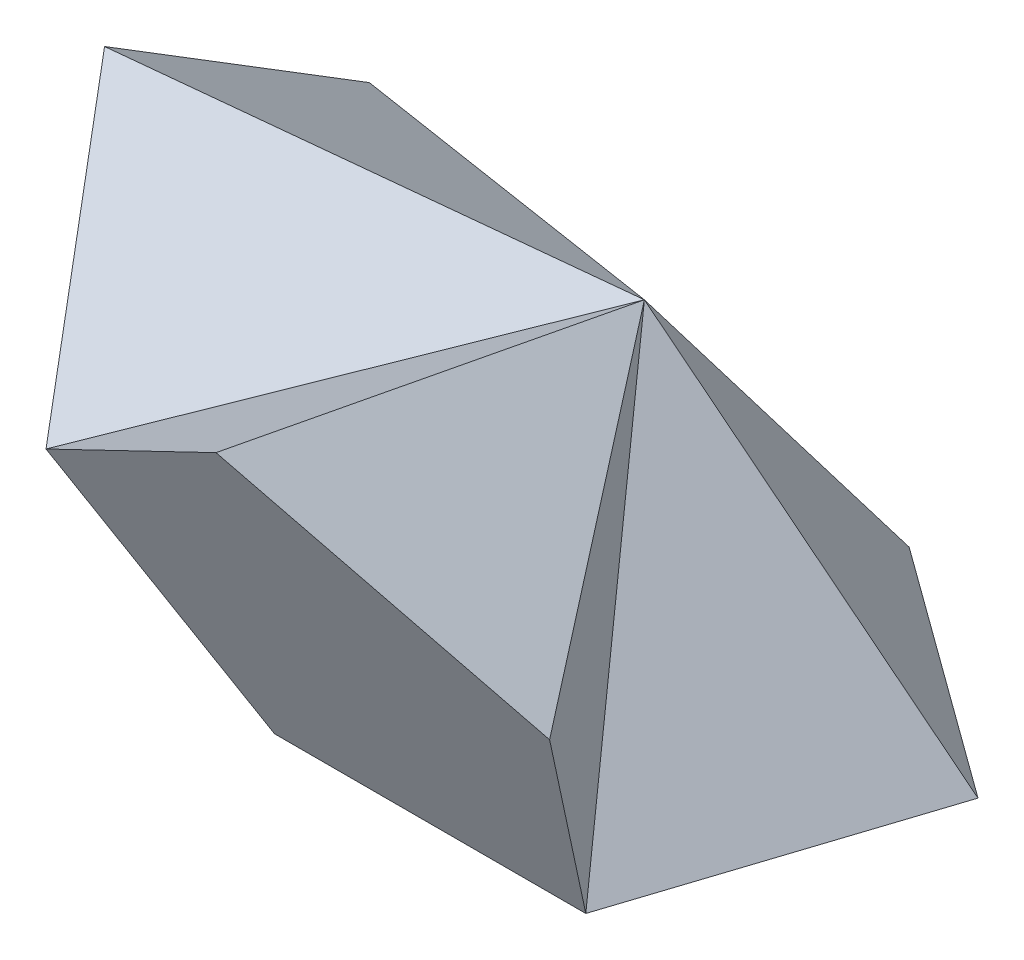
ISO-10303-21;
HEADER;
FILE_DESCRIPTION(('STEP AP214'),'2;1');
FILE_NAME('part.step','',(''),(''),'','','');
FILE_SCHEMA(('AUTOMOTIVE_DESIGN { 1 0 10303 214 1 1 1 1 }'));
ENDSEC;
DATA;
#1=APPLICATION_CONTEXT('core data for automotive mechanical design processes');
#2=APPLICATION_PROTOCOL_DEFINITION('international standard','automotive_design',2000,#1);
#3=PRODUCT_CONTEXT('',#1,'mechanical');
#4=PRODUCT('Part','Part','',(#3));
#5=PRODUCT_RELATED_PRODUCT_CATEGORY('part','',(#4));
#6=PRODUCT_DEFINITION_FORMATION('','',#4);
#7=PRODUCT_DEFINITION_CONTEXT('part definition',#1,'design');
#8=PRODUCT_DEFINITION('design','',#6,#7);
#9=PRODUCT_DEFINITION_SHAPE('','',#8);
#10=(LENGTH_UNIT() NAMED_UNIT(*) SI_UNIT(.MILLI.,.METRE.));
#11=(NAMED_UNIT(*) PLANE_ANGLE_UNIT() SI_UNIT($,.RADIAN.));
#12=(NAMED_UNIT(*) SI_UNIT($,.STERADIAN.) SOLID_ANGLE_UNIT());
#13=UNCERTAINTY_MEASURE_WITH_UNIT(LENGTH_MEASURE(1.E-05),#10,'distance_accuracy_value','');
#14=(GEOMETRIC_REPRESENTATION_CONTEXT(3) GLOBAL_UNCERTAINTY_ASSIGNED_CONTEXT((#13)) GLOBAL_UNIT_ASSIGNED_CONTEXT((#10,
#11,#12)) REPRESENTATION_CONTEXT('',''));
#15=CARTESIAN_POINT('',(0.,0.,0.));
#16=DIRECTION('',(0.,0.,1.));
#17=DIRECTION('',(1.,0.,0.));
#18=AXIS2_PLACEMENT_3D('',#15,#16,#17);
#19=CARTESIAN_POINT('',(10.2745158285618,0.,-3.33839256195651));
#20=DIRECTION('',(0.499999999999999,0.525731112119135,-0.688190960235587));
#21=DIRECTION('',(0.,0.794654472291766,0.607061998206687));
#22=AXIS2_PLACEMENT_3D('',#19,#20,#21);
#23=PLANE('',#22);
#24=DIRECTION('',(-0.809016994374948,0.,-0.587785252292472));
#25=VECTOR('',#24,1.);
#26=CARTESIAN_POINT('',(10.2745158285618,0.,-3.33839256195651));
#27=LINE('',#26,#25);
#28=CARTESIAN_POINT('',(10.2745158285618,0.,-3.33839256195651));
#29=VERTEX_POINT('',#28);
#30=CARTESIAN_POINT('',(0.,0.,-10.8032652660709));
#31=VERTEX_POINT('',#30);
#32=EDGE_CURVE('E126',#29,#31,#27,.T.);
#33=ORIENTED_EDGE('',*,*,#32,.T.);
#34=DIRECTION('',(0.,-0.794654472291765,-0.607061998206687));
#35=VECTOR('',#34,1.);
#36=CARTESIAN_POINT('',(0.,0.,-10.8032652660709));
#37=LINE('',#36,#35);
#38=CARTESIAN_POINT('',(0.,14.1416578280274,0.));
#39=VERTEX_POINT('',#38);
#40=EDGE_CURVE('E11',#39,#31,#37,.T.);
#41=ORIENTED_EDGE('',*,*,#40,.F.);
#42=DIRECTION('',(0.577350269189626,-0.794654472291765,-0.187592474085081));
#43=VECTOR('',#42,1.);
#44=CARTESIAN_POINT('',(10.2745158285618,0.,-3.33839256195651));
#45=LINE('',#44,#43);
#46=EDGE_CURVE('E49',#39,#29,#45,.T.);
#47=ORIENTED_EDGE('',*,*,#46,.T.);
#48=EDGE_LOOP('',(#33,#41,#47));
#49=FACE_BOUND('',#48,.T.);
#50=ADVANCED_FACE('F33',(#49),#23,.T.);
#51=CARTESIAN_POINT('',(0.,0.,-10.8032652660709));
#52=DIRECTION('',(-0.500000000000001,0.525731112119135,-0.688190960235585));
#53=DIRECTION('',(0.,0.794654472291765,0.607061998206688));
#54=AXIS2_PLACEMENT_3D('',#51,#52,#53);
#55=PLANE('',#54);
#56=DIRECTION('',(-0.809016994374946,0.,0.587785252292474));
#57=VECTOR('',#56,1.);
#58=CARTESIAN_POINT('',(0.,0.,-10.8032652660709));
#59=LINE('',#58,#57);
#60=CARTESIAN_POINT('',(-10.2745158285618,0.,-3.33839256195648));
#61=VERTEX_POINT('',#60);
#62=EDGE_CURVE('E130',#31,#61,#59,.T.);
#63=ORIENTED_EDGE('',*,*,#62,.T.);
#64=DIRECTION('',(-0.577350269189627,-0.794654472291765,-0.187592474085079));
#65=VECTOR('',#64,1.);
#66=CARTESIAN_POINT('',(-10.2745158285618,0.,-3.33839256195648));
#67=LINE('',#66,#65);
#68=EDGE_CURVE('E37',#39,#61,#67,.T.);
#69=ORIENTED_EDGE('',*,*,#68,.F.);
#70=ORIENTED_EDGE('',*,*,#40,.T.);
#71=EDGE_LOOP('',(#63,#69,#70));
#72=FACE_BOUND('',#71,.T.);
#73=ADVANCED_FACE('F35',(#72),#55,.T.);
#74=CARTESIAN_POINT('',(6.35000000000002,0.,8.74002519499195));
#75=DIRECTION('',(0.809016994374947,0.525731112119135,0.262865556059565));
#76=DIRECTION('',(-0.544893675596392,0.838505147446963,0.));
#77=AXIS2_PLACEMENT_3D('',#74,#75,#76);
#78=PLANE('',#77);
#79=DIRECTION('',(0.309016994374946,0.,-0.951056516295154));
#80=VECTOR('',#79,1.);
#81=CARTESIAN_POINT('',(6.35000000000002,0.,8.74002519499195));
#82=LINE('',#81,#80);
#83=CARTESIAN_POINT('',(6.35000000000002,0.,8.74002519499195));
#84=VERTEX_POINT('',#83);
#85=EDGE_CURVE('E138',#84,#29,#82,.T.);
#86=ORIENTED_EDGE('',*,*,#85,.T.);
#87=ORIENTED_EDGE('',*,*,#46,.F.);
#88=DIRECTION('',(0.356822089773091,-0.794654472291765,0.491123473188423));
#89=VECTOR('',#88,1.);
#90=CARTESIAN_POINT('',(6.35000000000002,0.,8.74002519499195));
#91=LINE('',#90,#89);
#92=EDGE_CURVE('E55',#39,#84,#91,.T.);
#93=ORIENTED_EDGE('',*,*,#92,.T.);
#94=EDGE_LOOP('',(#86,#87,#93));
#95=FACE_BOUND('',#94,.T.);
#96=ADVANCED_FACE('F175',(#95),#78,.T.);
#97=CARTESIAN_POINT('',(0.,0.,0.));
#98=DIRECTION('',(0.,1.,0.));
#99=DIRECTION('',(0.,0.,1.));
#100=AXIS2_PLACEMENT_3D('',#97,#98,#99);
#101=PLANE('',#100);
#102=ORIENTED_EDGE('',*,*,#32,.F.);
#103=ORIENTED_EDGE('',*,*,#85,.F.);
#104=DIRECTION('',(1.,0.,0.));
#105=VECTOR('',#104,1.);
#106=CARTESIAN_POINT('',(-6.34999999999999,0.,8.74002519499197));
#107=LINE('',#106,#105);
#108=CARTESIAN_POINT('',(-6.34999999999999,0.,8.74002519499197));
#109=VERTEX_POINT('',#108);
#110=EDGE_CURVE('E135',#109,#84,#107,.T.);
#111=ORIENTED_EDGE('',*,*,#110,.F.);
#112=DIRECTION('',(0.309016994374949,0.,0.951056516295153));
#113=VECTOR('',#112,1.);
#114=CARTESIAN_POINT('',(-10.2745158285618,0.,-3.33839256195648));
#115=LINE('',#114,#113);
#116=EDGE_CURVE('E133',#61,#109,#115,.T.);
#117=ORIENTED_EDGE('',*,*,#116,.F.);
#118=ORIENTED_EDGE('',*,*,#62,.F.);
#119=EDGE_LOOP('',(#102,#103,#111,#117,#118));
#120=FACE_BOUND('',#119,.T.);
#121=ADVANCED_FACE('F147',(#120),#101,.F.);
#122=CARTESIAN_POINT('',(10.2745158285619,10.8032652660709,14.1416578280274));
#123=DIRECTION('',(0.5,0.850650808352039,-0.162459848116457));
#124=DIRECTION('',(-0.862103722396976,0.506731853971386,0.));
#125=AXIS2_PLACEMENT_3D('',#122,#123,#124);
#126=PLANE('',#125);
#127=DIRECTION('',(-0.809016994374947,0.525731112119134,0.262865556059567));
#128=VECTOR('',#127,1.);
#129=CARTESIAN_POINT('',(10.2745158285619,10.8032652660709,14.1416578280274));
#130=LINE('',#129,#128);
#131=CARTESIAN_POINT('',(10.2745158285619,10.8032652660709,14.1416578280274));
#132=VERTEX_POINT('',#131);
#133=CARTESIAN_POINT('',(0.,17.4800503899839,17.4800503899839));
#134=VERTEX_POINT('',#133);
#135=EDGE_CURVE('E96',#132,#134,#130,.T.);
#136=ORIENTED_EDGE('',*,*,#135,.F.);
#137=DIRECTION('',(0.577350269189628,-0.187592474085077,0.794654472291765));
#138=VECTOR('',#137,1.);
#139=CARTESIAN_POINT('',(7.65817194285396,11.6533669266559,10.5405694060037));
#140=LINE('',#139,#138);
#141=EDGE_CURVE('E124',#39,#132,#140,.T.);
#142=ORIENTED_EDGE('',*,*,#141,.F.);
#143=DIRECTION('',(0.,0.187592474085083,0.982246946376845));
#144=VECTOR('',#143,1.);
#145=CARTESIAN_POINT('',(0.,16.6299487293989,13.0288603073752));
#146=LINE('',#145,#144);
#147=EDGE_CURVE('E123',#39,#134,#146,.T.);
#148=ORIENTED_EDGE('',*,*,#147,.T.);
#149=EDGE_LOOP('',(#136,#142,#148));
#150=FACE_BOUND('',#149,.T.);
#151=ADVANCED_FACE('F158',(#150),#126,.T.);
#152=CARTESIAN_POINT('',(6.35000000000002,0.,8.74002519499195));
#153=DIRECTION('',(0.809016994374946,0.,-0.587785252292475));
#154=DIRECTION('',(-0.587785252292475,0.,-0.809016994374946));
#155=AXIS2_PLACEMENT_3D('',#152,#153,#154);
#156=PLANE('',#155);
#157=DIRECTION('',(0.309016994374949,0.850650808352041,0.425325404176018));
#158=VECTOR('',#157,1.);
#159=CARTESIAN_POINT('',(6.35000000000002,0.,8.74002519499195));
#160=LINE('',#159,#158);
#161=EDGE_CURVE('E116',#84,#132,#160,.T.);
#162=ORIENTED_EDGE('',*,*,#161,.F.);
#163=ORIENTED_EDGE('',*,*,#92,.F.);
#164=ORIENTED_EDGE('',*,*,#141,.T.);
#165=EDGE_LOOP('',(#162,#163,#164));
#166=FACE_BOUND('',#165,.T.);
#167=ADVANCED_FACE('F160',(#166),#156,.T.);
#168=CARTESIAN_POINT('',(0.,17.4800503899839,17.4800503899839));
#169=DIRECTION('',(-0.5,0.85065080835204,-0.162459848116455));
#170=DIRECTION('',(-0.862103722396976,-0.506731853971386,0.));
#171=AXIS2_PLACEMENT_3D('',#168,#169,#170);
#172=PLANE('',#171);
#173=DIRECTION('',(-0.809016994374948,-0.525731112119134,-0.262865556059564));
#174=VECTOR('',#173,1.);
#175=CARTESIAN_POINT('',(0.,17.4800503899839,17.4800503899839));
#176=LINE('',#175,#174);
#177=CARTESIAN_POINT('',(-10.2745158285618,10.8032652660709,14.1416578280274));
#178=VERTEX_POINT('',#177);
#179=EDGE_CURVE('E120',#134,#178,#176,.T.);
#180=ORIENTED_EDGE('',*,*,#179,.F.);
#181=ORIENTED_EDGE('',*,*,#147,.F.);
#182=DIRECTION('',(-0.577350269189625,-0.187592474085077,0.794654472291767));
#183=VECTOR('',#182,1.);
#184=CARTESIAN_POINT('',(-7.65817194285392,11.6533669266559,10.5405694060038));
#185=LINE('',#184,#183);
#186=EDGE_CURVE('E92',#39,#178,#185,.T.);
#187=ORIENTED_EDGE('',*,*,#186,.T.);
#188=EDGE_LOOP('',(#180,#181,#187));
#189=FACE_BOUND('',#188,.T.);
#190=ADVANCED_FACE('F155',(#189),#172,.T.);
#191=CARTESIAN_POINT('',(0.,7.81731618442516,12.6486832872045));
#192=DIRECTION('',(0.,0.447213595499956,-0.894427190999917));
#193=DIRECTION('',(0.,-0.894427190999917,-0.447213595499956));
#194=AXIS2_PLACEMENT_3D('',#191,#192,#193);
#195=PLANE('',#194);
#196=ORIENTED_EDGE('',*,*,#135,.T.);
#197=ORIENTED_EDGE('',*,*,#179,.T.);
#198=DIRECTION('',(0.309016994374946,-0.850650808352041,-0.425325404176019));
#199=VECTOR('',#198,1.);
#200=CARTESIAN_POINT('',(-10.2745158285618,10.8032652660709,14.1416578280274));
#201=LINE('',#200,#199);
#202=EDGE_CURVE('E108',#178,#109,#201,.T.);
#203=ORIENTED_EDGE('',*,*,#202,.T.);
#204=ORIENTED_EDGE('',*,*,#110,.T.);
#205=ORIENTED_EDGE('',*,*,#161,.T.);
#206=EDGE_LOOP('',(#196,#197,#203,#204,#205));
#207=FACE_BOUND('',#206,.T.);
#208=ADVANCED_FACE('F150',(#207),#195,.F.);
#209=CARTESIAN_POINT('',(-16.6245158285618,17.4800503899839,5.40163263303547));
#210=DIRECTION('',(0.,0.85065080835204,-0.525731112119134));
#211=DIRECTION('',(0.,0.525731112119134,0.85065080835204));
#212=AXIS2_PLACEMENT_3D('',#209,#210,#211);
#213=PLANE('',#212);
#214=DIRECTION('',(0.,-0.525731112119134,-0.85065080835204));
#215=VECTOR('',#214,1.);
#216=CARTESIAN_POINT('',(-16.6245158285618,17.4800503899839,5.40163263303547));
#217=LINE('',#216,#215);
#218=CARTESIAN_POINT('',(-16.6245158285618,17.4800503899839,5.40163263303547));
#219=VERTEX_POINT('',#218);
#220=CARTESIAN_POINT('',(-16.6245158285618,10.8032652660709,-5.40163263303544));
#221=VERTEX_POINT('',#220);
#222=EDGE_CURVE('E100',#219,#221,#217,.T.);
#223=ORIENTED_EDGE('',*,*,#222,.F.);
#224=DIRECTION('',(-0.934172358962715,0.187592474085083,0.303530999103344));
#225=VECTOR('',#224,1.);
#226=CARTESIAN_POINT('',(-12.3911824952285,16.6299487293989,4.02613925231616));
#227=LINE('',#226,#225);
#228=EDGE_CURVE('E85',#39,#219,#227,.T.);
#229=ORIENTED_EDGE('',*,*,#228,.F.);
#230=DIRECTION('',(-0.934172358962716,-0.187592474085077,-0.303530999103343));
#231=VECTOR('',#230,1.);
#232=CARTESIAN_POINT('',(-12.3911824952285,11.6533669266559,-4.02613925231614));
#233=LINE('',#232,#231);
#234=EDGE_CURVE('E97',#39,#221,#233,.T.);
#235=ORIENTED_EDGE('',*,*,#234,.T.);
#236=EDGE_LOOP('',(#223,#229,#235));
#237=FACE_BOUND('',#236,.T.);
#238=ADVANCED_FACE('F101',(#237),#213,.T.);
#239=CARTESIAN_POINT('',(-10.2745158285618,10.8032652660709,14.1416578280274));
#240=DIRECTION('',(0.309016994374951,0.85065080835204,0.425325404176018));
#241=DIRECTION('',(0.,-0.447213595499957,0.894427190999917));
#242=AXIS2_PLACEMENT_3D('',#239,#240,#241);
#243=PLANE('',#242);
#244=DIRECTION('',(-0.5,0.525731112119134,-0.688190960235586));
#245=VECTOR('',#244,1.);
#246=CARTESIAN_POINT('',(-10.2745158285618,10.8032652660709,14.1416578280274));
#247=LINE('',#246,#245);
#248=EDGE_CURVE('E89',#178,#219,#247,.T.);
#249=ORIENTED_EDGE('',*,*,#248,.F.);
#250=ORIENTED_EDGE('',*,*,#186,.F.);
#251=ORIENTED_EDGE('',*,*,#228,.T.);
#252=EDGE_LOOP('',(#249,#250,#251));
#253=FACE_BOUND('',#252,.T.);
#254=ADVANCED_FACE('F87',(#253),#243,.T.);
#255=CARTESIAN_POINT('',(-16.6245158285618,10.8032652660709,-5.40163263303544));
#256=DIRECTION('',(0.309016994374947,0.,-0.951056516295154));
#257=DIRECTION('',(-0.951056516295154,0.,-0.309016994374947));
#258=AXIS2_PLACEMENT_3D('',#255,#256,#257);
#259=PLANE('',#258);
#260=DIRECTION('',(0.499999999999999,-0.850650808352041,0.162459848116453));
#261=VECTOR('',#260,1.);
#262=CARTESIAN_POINT('',(-16.6245158285618,10.8032652660709,-5.40163263303544));
#263=LINE('',#262,#261);
#264=EDGE_CURVE('E109',#221,#61,#263,.T.);
#265=ORIENTED_EDGE('',*,*,#264,.F.);
#266=ORIENTED_EDGE('',*,*,#234,.F.);
#267=ORIENTED_EDGE('',*,*,#68,.T.);
#268=EDGE_LOOP('',(#265,#266,#267));
#269=FACE_BOUND('',#268,.T.);
#270=ADVANCED_FACE('F141',(#269),#259,.T.);
#271=CARTESIAN_POINT('',(-12.0296126628494,7.81731618442516,3.90865809221258));
#272=DIRECTION('',(0.850650808352041,0.447213595499956,-0.276393202250023));
#273=DIRECTION('',(0.425325404176021,-0.276393202250023,0.861803398874988));
#274=AXIS2_PLACEMENT_3D('',#271,#272,#273);
#275=PLANE('',#274);
#276=ORIENTED_EDGE('',*,*,#222,.T.);
#277=ORIENTED_EDGE('',*,*,#264,.T.);
#278=ORIENTED_EDGE('',*,*,#116,.T.);
#279=ORIENTED_EDGE('',*,*,#202,.F.);
#280=ORIENTED_EDGE('',*,*,#248,.T.);
#281=EDGE_LOOP('',(#276,#277,#278,#279,#280));
#282=FACE_BOUND('',#281,.T.);
#283=ADVANCED_FACE('F106',(#282),#275,.F.);
#284=CLOSED_SHELL('',(#50,#73,#96,#121,#151,#167,#190,#208,#238,#254,#270,#283));
#285=MANIFOLD_SOLID_BREP('B2',#284);
#286=ADVANCED_BREP_SHAPE_REPRESENTATION('',(#18,#285),#14);
#287=SHAPE_DEFINITION_REPRESENTATION(#9,#286);
ENDSEC;
END-ISO-10303-21;
